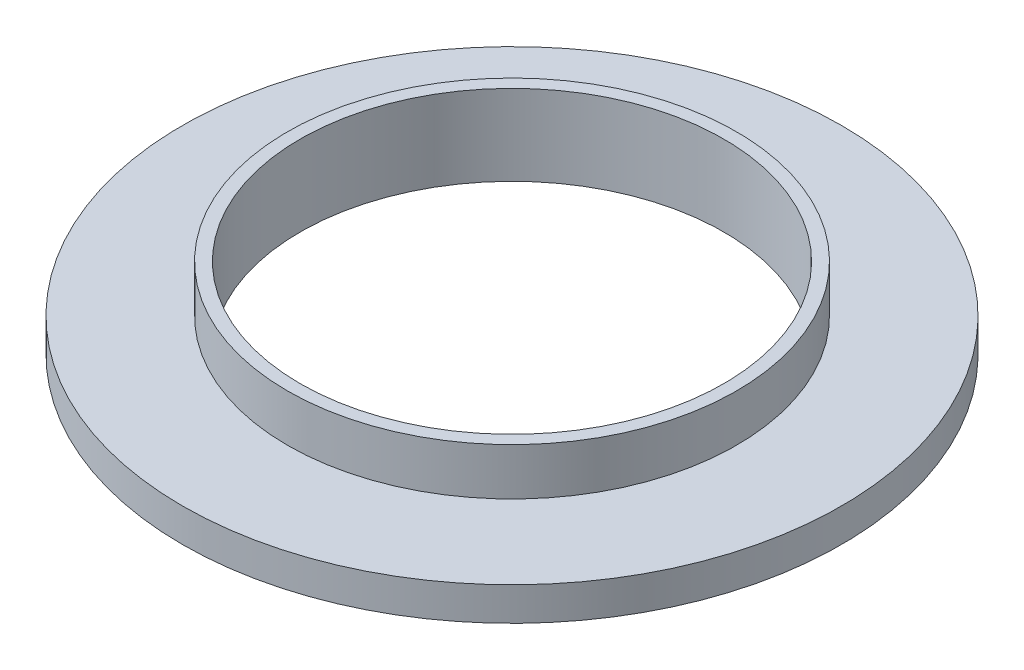
ISO-10303-21;
HEADER;
FILE_DESCRIPTION(('STEP AP214'),'2;1');
FILE_NAME('part.step','',(''),(''),'','','');
FILE_SCHEMA(('AUTOMOTIVE_DESIGN { 1 0 10303 214 1 1 1 1 }'));
ENDSEC;
DATA;
#1=APPLICATION_CONTEXT('core data for automotive mechanical design processes');
#2=APPLICATION_PROTOCOL_DEFINITION('international standard','automotive_design',2000,#1);
#3=PRODUCT_CONTEXT('',#1,'mechanical');
#4=PRODUCT('Part','Part','',(#3));
#5=PRODUCT_RELATED_PRODUCT_CATEGORY('part','',(#4));
#6=PRODUCT_DEFINITION_FORMATION('','',#4);
#7=PRODUCT_DEFINITION_CONTEXT('part definition',#1,'design');
#8=PRODUCT_DEFINITION('design','',#6,#7);
#9=PRODUCT_DEFINITION_SHAPE('','',#8);
#10=(LENGTH_UNIT() NAMED_UNIT(*) SI_UNIT(.MILLI.,.METRE.));
#11=(NAMED_UNIT(*) PLANE_ANGLE_UNIT() SI_UNIT($,.RADIAN.));
#12=(NAMED_UNIT(*) SI_UNIT($,.STERADIAN.) SOLID_ANGLE_UNIT());
#13=UNCERTAINTY_MEASURE_WITH_UNIT(LENGTH_MEASURE(1.E-05),#10,'distance_accuracy_value','');
#14=(GEOMETRIC_REPRESENTATION_CONTEXT(3) GLOBAL_UNCERTAINTY_ASSIGNED_CONTEXT((#13)) GLOBAL_UNIT_ASSIGNED_CONTEXT((#10,
#11,#12)) REPRESENTATION_CONTEXT('',''));
#15=CARTESIAN_POINT('',(0.,0.,0.));
#16=DIRECTION('',(0.,0.,1.));
#17=DIRECTION('',(1.,0.,0.));
#18=AXIS2_PLACEMENT_3D('',#15,#16,#17);
#19=CARTESIAN_POINT('',(0.,1.42,0.));
#20=DIRECTION('',(0.,1.,0.));
#21=DIRECTION('',(0.,0.,1.));
#22=AXIS2_PLACEMENT_3D('',#19,#20,#21);
#23=PLANE('',#22);
#24=CARTESIAN_POINT('',(0.,1.42,0.));
#25=DIRECTION('',(0.,1.,0.));
#26=DIRECTION('',(0.,0.,1.));
#27=AXIS2_PLACEMENT_3D('',#24,#25,#26);
#28=CIRCLE('',#27,14.);
#29=CARTESIAN_POINT('',(0.,1.42,14.));
#30=VERTEX_POINT('',#29);
#31=EDGE_CURVE('E10',#30,#30,#28,.T.);
#32=ORIENTED_EDGE('',*,*,#31,.T.);
#33=EDGE_LOOP('',(#32));
#34=FACE_BOUND('',#33,.T.);
#35=CARTESIAN_POINT('',(0.,1.42,0.));
#36=DIRECTION('',(0.,1.,0.));
#37=DIRECTION('',(0.,0.,1.));
#38=AXIS2_PLACEMENT_3D('',#35,#36,#37);
#39=CIRCLE('',#38,9.5377);
#40=CARTESIAN_POINT('',(0.,1.42,9.5377));
#41=VERTEX_POINT('',#40);
#42=EDGE_CURVE('E46',#41,#41,#39,.T.);
#43=ORIENTED_EDGE('',*,*,#42,.F.);
#44=EDGE_LOOP('',(#43));
#45=FACE_BOUND('',#44,.T.);
#46=ADVANCED_FACE('F30',(#34,#45),#23,.T.);
#47=CARTESIAN_POINT('',(0.,0.,0.));
#48=DIRECTION('',(0.,1.,0.));
#49=DIRECTION('',(0.,0.,1.));
#50=AXIS2_PLACEMENT_3D('',#47,#48,#49);
#51=PLANE('',#50);
#52=CARTESIAN_POINT('',(0.,0.,0.));
#53=DIRECTION('',(0.,1.,0.));
#54=DIRECTION('',(0.,0.,1.));
#55=AXIS2_PLACEMENT_3D('',#52,#53,#54);
#56=CIRCLE('',#55,14.);
#57=CARTESIAN_POINT('',(0.,0.,14.));
#58=VERTEX_POINT('',#57);
#59=EDGE_CURVE('E34',#58,#58,#56,.T.);
#60=ORIENTED_EDGE('',*,*,#59,.F.);
#61=EDGE_LOOP('',(#60));
#62=FACE_BOUND('',#61,.T.);
#63=CARTESIAN_POINT('',(0.,0.,0.));
#64=DIRECTION('',(0.,1.,0.));
#65=DIRECTION('',(0.,0.,1.));
#66=AXIS2_PLACEMENT_3D('',#63,#64,#65);
#67=CIRCLE('',#66,9.);
#68=CARTESIAN_POINT('',(0.,0.,9.));
#69=VERTEX_POINT('',#68);
#70=EDGE_CURVE('E41',#69,#69,#67,.T.);
#71=ORIENTED_EDGE('',*,*,#70,.T.);
#72=EDGE_LOOP('',(#71));
#73=FACE_BOUND('',#72,.T.);
#74=ADVANCED_FACE('F71',(#62,#73),#51,.F.);
#75=CARTESIAN_POINT('',(0.,1.42,0.));
#76=DIRECTION('',(0.,-1.,0.));
#77=DIRECTION('',(0.,0.,-1.));
#78=AXIS2_PLACEMENT_3D('',#75,#76,#77);
#79=CYLINDRICAL_SURFACE('',#78,14.);
#80=ORIENTED_EDGE('',*,*,#31,.F.);
#81=EDGE_LOOP('',(#80));
#82=FACE_BOUND('',#81,.T.);
#83=ORIENTED_EDGE('',*,*,#59,.T.);
#84=EDGE_LOOP('',(#83));
#85=FACE_BOUND('',#84,.T.);
#86=ADVANCED_FACE('F32',(#82,#85),#79,.T.);
#87=CARTESIAN_POINT('',(0.,1.42,0.));
#88=DIRECTION('',(0.,-1.,0.));
#89=DIRECTION('',(0.,0.,-1.));
#90=AXIS2_PLACEMENT_3D('',#87,#88,#89);
#91=CYLINDRICAL_SURFACE('',#90,9.);
#92=ORIENTED_EDGE('',*,*,#70,.F.);
#93=EDGE_LOOP('',(#92));
#94=FACE_BOUND('',#93,.T.);
#95=CARTESIAN_POINT('',(0.,3.42,0.));
#96=DIRECTION('',(0.,1.,0.));
#97=DIRECTION('',(0.,0.,1.));
#98=AXIS2_PLACEMENT_3D('',#95,#96,#97);
#99=CIRCLE('',#98,9.);
#100=CARTESIAN_POINT('',(0.,3.42,9.));
#101=VERTEX_POINT('',#100);
#102=EDGE_CURVE('E49',#101,#101,#99,.T.);
#103=ORIENTED_EDGE('',*,*,#102,.T.);
#104=EDGE_LOOP('',(#103));
#105=FACE_BOUND('',#104,.T.);
#106=ADVANCED_FACE('F55',(#94,#105),#91,.F.);
#107=CARTESIAN_POINT('',(0.,3.42,0.));
#108=DIRECTION('',(0.,1.,0.));
#109=DIRECTION('',(0.,0.,1.));
#110=AXIS2_PLACEMENT_3D('',#107,#108,#109);
#111=PLANE('',#110);
#112=CARTESIAN_POINT('',(0.,3.42,0.));
#113=DIRECTION('',(0.,1.,0.));
#114=DIRECTION('',(0.,0.,1.));
#115=AXIS2_PLACEMENT_3D('',#112,#113,#114);
#116=CIRCLE('',#115,9.5377);
#117=CARTESIAN_POINT('',(0.,3.42,9.5377));
#118=VERTEX_POINT('',#117);
#119=EDGE_CURVE('E45',#118,#118,#116,.T.);
#120=ORIENTED_EDGE('',*,*,#119,.T.);
#121=EDGE_LOOP('',(#120));
#122=FACE_BOUND('',#121,.T.);
#123=ORIENTED_EDGE('',*,*,#102,.F.);
#124=EDGE_LOOP('',(#123));
#125=FACE_BOUND('',#124,.T.);
#126=ADVANCED_FACE('F57',(#122,#125),#111,.T.);
#127=CARTESIAN_POINT('',(0.,3.42,0.));
#128=DIRECTION('',(0.,-1.,0.));
#129=DIRECTION('',(0.,0.,-1.));
#130=AXIS2_PLACEMENT_3D('',#127,#128,#129);
#131=CYLINDRICAL_SURFACE('',#130,9.5377);
#132=ORIENTED_EDGE('',*,*,#119,.F.);
#133=EDGE_LOOP('',(#132));
#134=FACE_BOUND('',#133,.T.);
#135=ORIENTED_EDGE('',*,*,#42,.T.);
#136=EDGE_LOOP('',(#135));
#137=FACE_BOUND('',#136,.T.);
#138=ADVANCED_FACE('F59',(#134,#137),#131,.T.);
#139=CLOSED_SHELL('',(#46,#74,#86,#106,#126,#138));
#140=MANIFOLD_SOLID_BREP('B2',#139);
#141=ADVANCED_BREP_SHAPE_REPRESENTATION('',(#18,#140),#14);
#142=SHAPE_DEFINITION_REPRESENTATION(#9,#141);
ENDSEC;
END-ISO-10303-21;
